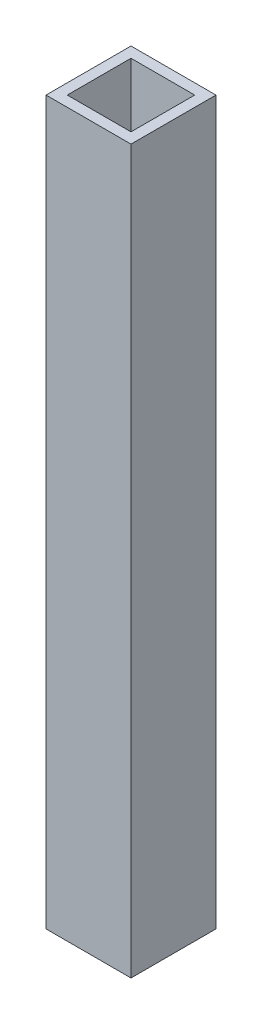
ISO-10303-21;
HEADER;
FILE_DESCRIPTION(('STEP AP214'),'2;1');
FILE_NAME('part.step','',(''),(''),'','','');
FILE_SCHEMA(('AUTOMOTIVE_DESIGN { 1 0 10303 214 1 1 1 1 }'));
ENDSEC;
DATA;
#1=APPLICATION_CONTEXT('core data for automotive mechanical design processes');
#2=APPLICATION_PROTOCOL_DEFINITION('international standard','automotive_design',2000,#1);
#3=PRODUCT_CONTEXT('',#1,'mechanical');
#4=PRODUCT('Part','Part','',(#3));
#5=PRODUCT_RELATED_PRODUCT_CATEGORY('part','',(#4));
#6=PRODUCT_DEFINITION_FORMATION('','',#4);
#7=PRODUCT_DEFINITION_CONTEXT('part definition',#1,'design');
#8=PRODUCT_DEFINITION('design','',#6,#7);
#9=PRODUCT_DEFINITION_SHAPE('','',#8);
#10=(LENGTH_UNIT() NAMED_UNIT(*) SI_UNIT(.MILLI.,.METRE.));
#11=(NAMED_UNIT(*) PLANE_ANGLE_UNIT() SI_UNIT($,.RADIAN.));
#12=(NAMED_UNIT(*) SI_UNIT($,.STERADIAN.) SOLID_ANGLE_UNIT());
#13=UNCERTAINTY_MEASURE_WITH_UNIT(LENGTH_MEASURE(1.E-05),#10,'distance_accuracy_value','');
#14=(GEOMETRIC_REPRESENTATION_CONTEXT(3) GLOBAL_UNCERTAINTY_ASSIGNED_CONTEXT((#13)) GLOBAL_UNIT_ASSIGNED_CONTEXT((#10,
#11,#12)) REPRESENTATION_CONTEXT('',''));
#15=CARTESIAN_POINT('',(0.,0.,0.));
#16=DIRECTION('',(0.,0.,1.));
#17=DIRECTION('',(1.,0.,0.));
#18=AXIS2_PLACEMENT_3D('',#15,#16,#17);
#19=CARTESIAN_POINT('',(-171.45,266.7,-3.84401965253075));
#20=DIRECTION('',(1.,0.,0.));
#21=DIRECTION('',(0.,0.,-1.));
#22=AXIS2_PLACEMENT_3D('',#19,#20,#21);
#23=PLANE('',#22);
#24=DIRECTION('',(0.,0.,1.));
#25=VECTOR('',#24,1.);
#26=CARTESIAN_POINT('',(-171.45,-165.1,-3.84401965253075));
#27=LINE('',#26,#25);
#28=CARTESIAN_POINT('',(-171.45,-165.1,6.35));
#29=VERTEX_POINT('',#28);
#30=CARTESIAN_POINT('',(-171.45,-165.1,44.45));
#31=VERTEX_POINT('',#30);
#32=EDGE_CURVE('E158',#29,#31,#27,.T.);
#33=ORIENTED_EDGE('',*,*,#32,.T.);
#34=DIRECTION('',(0.,-1.,0.));
#35=VECTOR('',#34,1.);
#36=CARTESIAN_POINT('',(-171.45,266.7,44.45));
#37=LINE('',#36,#35);
#38=CARTESIAN_POINT('',(-171.45,266.7,44.45));
#39=VERTEX_POINT('',#38);
#40=EDGE_CURVE('E11',#39,#31,#37,.T.);
#41=ORIENTED_EDGE('',*,*,#40,.F.);
#42=DIRECTION('',(0.,0.,1.));
#43=VECTOR('',#42,1.);
#44=CARTESIAN_POINT('',(-171.45,266.7,-3.84401965253075));
#45=LINE('',#44,#43);
#46=CARTESIAN_POINT('',(-171.45,266.7,6.35));
#47=VERTEX_POINT('',#46);
#48=EDGE_CURVE('E118',#47,#39,#45,.T.);
#49=ORIENTED_EDGE('',*,*,#48,.F.);
#50=DIRECTION('',(0.,-1.,0.));
#51=VECTOR('',#50,1.);
#52=CARTESIAN_POINT('',(-171.45,266.7,6.35));
#53=LINE('',#52,#51);
#54=EDGE_CURVE('E41',#47,#29,#53,.T.);
#55=ORIENTED_EDGE('',*,*,#54,.T.);
#56=EDGE_LOOP('',(#33,#41,#49,#55));
#57=FACE_BOUND('',#56,.T.);
#58=ADVANCED_FACE('F16',(#57),#23,.F.);
#59=CARTESIAN_POINT('',(-173.697840166092,266.7,44.45));
#60=DIRECTION('',(0.,0.,1.));
#61=DIRECTION('',(1.,0.,0.));
#62=AXIS2_PLACEMENT_3D('',#59,#60,#61);
#63=PLANE('',#62);
#64=DIRECTION('',(-1.,0.,0.));
#65=VECTOR('',#64,1.);
#66=CARTESIAN_POINT('',(-173.697840166092,-165.1,44.45));
#67=LINE('',#66,#65);
#68=CARTESIAN_POINT('',(-209.55,-165.1,44.45));
#69=VERTEX_POINT('',#68);
#70=EDGE_CURVE('E125',#31,#69,#67,.T.);
#71=ORIENTED_EDGE('',*,*,#70,.T.);
#72=DIRECTION('',(0.,-1.,0.));
#73=VECTOR('',#72,1.);
#74=CARTESIAN_POINT('',(-209.55,266.7,44.45));
#75=LINE('',#74,#73);
#76=CARTESIAN_POINT('',(-209.55,266.7,44.45));
#77=VERTEX_POINT('',#76);
#78=EDGE_CURVE('E27',#77,#69,#75,.T.);
#79=ORIENTED_EDGE('',*,*,#78,.F.);
#80=DIRECTION('',(-1.,0.,0.));
#81=VECTOR('',#80,1.);
#82=CARTESIAN_POINT('',(-173.697840166092,266.7,44.45));
#83=LINE('',#82,#81);
#84=EDGE_CURVE('E112',#39,#77,#83,.T.);
#85=ORIENTED_EDGE('',*,*,#84,.F.);
#86=ORIENTED_EDGE('',*,*,#40,.T.);
#87=EDGE_LOOP('',(#71,#79,#85,#86));
#88=FACE_BOUND('',#87,.T.);
#89=ADVANCED_FACE('F124',(#88),#63,.F.);
#90=CARTESIAN_POINT('',(-209.55,266.7,-3.84401965253073));
#91=DIRECTION('',(1.,0.,0.));
#92=DIRECTION('',(0.,0.,-1.));
#93=AXIS2_PLACEMENT_3D('',#90,#91,#92);
#94=PLANE('',#93);
#95=DIRECTION('',(0.,0.,1.));
#96=VECTOR('',#95,1.);
#97=CARTESIAN_POINT('',(-209.55,-165.1,-3.84401965253073));
#98=LINE('',#97,#96);
#99=CARTESIAN_POINT('',(-209.55,-165.1,6.35));
#100=VERTEX_POINT('',#99);
#101=EDGE_CURVE('E163',#100,#69,#98,.T.);
#102=ORIENTED_EDGE('',*,*,#101,.F.);
#103=DIRECTION('',(0.,-1.,0.));
#104=VECTOR('',#103,1.);
#105=CARTESIAN_POINT('',(-209.55,266.7,6.35));
#106=LINE('',#105,#104);
#107=CARTESIAN_POINT('',(-209.55,266.7,6.35));
#108=VERTEX_POINT('',#107);
#109=EDGE_CURVE('E75',#108,#100,#106,.T.);
#110=ORIENTED_EDGE('',*,*,#109,.F.);
#111=DIRECTION('',(0.,0.,1.));
#112=VECTOR('',#111,1.);
#113=CARTESIAN_POINT('',(-209.55,266.7,-3.84401965253073));
#114=LINE('',#113,#112);
#115=EDGE_CURVE('E117',#108,#77,#114,.T.);
#116=ORIENTED_EDGE('',*,*,#115,.T.);
#117=ORIENTED_EDGE('',*,*,#78,.T.);
#118=EDGE_LOOP('',(#102,#110,#116,#117));
#119=FACE_BOUND('',#118,.T.);
#120=ADVANCED_FACE('F130',(#119),#94,.T.);
#121=CARTESIAN_POINT('',(-190.5,266.7,50.8));
#122=DIRECTION('',(0.,0.,1.));
#123=DIRECTION('',(1.,0.,0.));
#124=AXIS2_PLACEMENT_3D('',#121,#122,#123);
#125=PLANE('',#124);
#126=DIRECTION('',(-1.,0.,0.));
#127=VECTOR('',#126,1.);
#128=CARTESIAN_POINT('',(-190.5,-165.1,50.8));
#129=LINE('',#128,#127);
#130=CARTESIAN_POINT('',(-165.1,-165.1,50.8));
#131=VERTEX_POINT('',#130);
#132=CARTESIAN_POINT('',(-215.9,-165.1,50.8));
#133=VERTEX_POINT('',#132);
#134=EDGE_CURVE('E142',#131,#133,#129,.T.);
#135=ORIENTED_EDGE('',*,*,#134,.F.);
#136=DIRECTION('',(0.,-1.,0.));
#137=VECTOR('',#136,1.);
#138=CARTESIAN_POINT('',(-165.1,266.7,50.8));
#139=LINE('',#138,#137);
#140=CARTESIAN_POINT('',(-165.1,266.7,50.8));
#141=VERTEX_POINT('',#140);
#142=EDGE_CURVE('E20',#141,#131,#139,.T.);
#143=ORIENTED_EDGE('',*,*,#142,.F.);
#144=DIRECTION('',(-1.,0.,0.));
#145=VECTOR('',#144,1.);
#146=CARTESIAN_POINT('',(-190.5,266.7,50.8));
#147=LINE('',#146,#145);
#148=CARTESIAN_POINT('',(-215.9,266.7,50.8));
#149=VERTEX_POINT('',#148);
#150=EDGE_CURVE('E170',#141,#149,#147,.T.);
#151=ORIENTED_EDGE('',*,*,#150,.T.);
#152=DIRECTION('',(0.,-1.,0.));
#153=VECTOR('',#152,1.);
#154=CARTESIAN_POINT('',(-215.9,266.7,50.8));
#155=LINE('',#154,#153);
#156=EDGE_CURVE('E138',#149,#133,#155,.T.);
#157=ORIENTED_EDGE('',*,*,#156,.T.);
#158=EDGE_LOOP('',(#135,#143,#151,#157));
#159=FACE_BOUND('',#158,.T.);
#160=ADVANCED_FACE('F18',(#159),#125,.T.);
#161=CARTESIAN_POINT('',(-165.1,266.7,2082.8));
#162=DIRECTION('',(-1.,0.,0.));
#163=DIRECTION('',(0.,0.,1.));
#164=AXIS2_PLACEMENT_3D('',#161,#162,#163);
#165=PLANE('',#164);
#166=DIRECTION('',(0.,0.,-1.));
#167=VECTOR('',#166,1.);
#168=CARTESIAN_POINT('',(-165.1,-165.1,2082.8));
#169=LINE('',#168,#167);
#170=CARTESIAN_POINT('',(-165.1,-165.1,0.));
#171=VERTEX_POINT('',#170);
#172=EDGE_CURVE('E146',#131,#171,#169,.T.);
#173=ORIENTED_EDGE('',*,*,#172,.T.);
#174=DIRECTION('',(0.,-1.,0.));
#175=VECTOR('',#174,1.);
#176=CARTESIAN_POINT('',(-165.1,266.7,0.));
#177=LINE('',#176,#175);
#178=CARTESIAN_POINT('',(-165.1,266.7,0.));
#179=VERTEX_POINT('',#178);
#180=EDGE_CURVE('E179',#179,#171,#177,.T.);
#181=ORIENTED_EDGE('',*,*,#180,.F.);
#182=DIRECTION('',(0.,0.,-1.));
#183=VECTOR('',#182,1.);
#184=CARTESIAN_POINT('',(-165.1,266.7,2082.8));
#185=LINE('',#184,#183);
#186=EDGE_CURVE('E192',#141,#179,#185,.T.);
#187=ORIENTED_EDGE('',*,*,#186,.F.);
#188=ORIENTED_EDGE('',*,*,#142,.T.);
#189=EDGE_LOOP('',(#173,#181,#187,#188));
#190=FACE_BOUND('',#189,.T.);
#191=ADVANCED_FACE('F191',(#190),#165,.F.);
#192=CARTESIAN_POINT('',(-190.5,266.7,0.));
#193=DIRECTION('',(0.,0.,-1.));
#194=DIRECTION('',(-1.,0.,0.));
#195=AXIS2_PLACEMENT_3D('',#192,#193,#194);
#196=PLANE('',#195);
#197=DIRECTION('',(1.,0.,0.));
#198=VECTOR('',#197,1.);
#199=CARTESIAN_POINT('',(-190.5,-165.1,0.));
#200=LINE('',#199,#198);
#201=CARTESIAN_POINT('',(-215.9,-165.1,0.));
#202=VERTEX_POINT('',#201);
#203=EDGE_CURVE('E150',#202,#171,#200,.T.);
#204=ORIENTED_EDGE('',*,*,#203,.F.);
#205=DIRECTION('',(0.,-1.,0.));
#206=VECTOR('',#205,1.);
#207=CARTESIAN_POINT('',(-215.9,266.7,0.));
#208=LINE('',#207,#206);
#209=CARTESIAN_POINT('',(-215.9,266.7,0.));
#210=VERTEX_POINT('',#209);
#211=EDGE_CURVE('E177',#210,#202,#208,.T.);
#212=ORIENTED_EDGE('',*,*,#211,.F.);
#213=DIRECTION('',(1.,0.,0.));
#214=VECTOR('',#213,1.);
#215=CARTESIAN_POINT('',(-190.5,266.7,0.));
#216=LINE('',#215,#214);
#217=EDGE_CURVE('E237',#210,#179,#216,.T.);
#218=ORIENTED_EDGE('',*,*,#217,.T.);
#219=ORIENTED_EDGE('',*,*,#180,.T.);
#220=EDGE_LOOP('',(#204,#212,#218,#219));
#221=FACE_BOUND('',#220,.T.);
#222=ADVANCED_FACE('F204',(#221),#196,.T.);
#223=CARTESIAN_POINT('',(-215.9,266.7,2082.8));
#224=DIRECTION('',(-1.,0.,0.));
#225=DIRECTION('',(0.,0.,1.));
#226=AXIS2_PLACEMENT_3D('',#223,#224,#225);
#227=PLANE('',#226);
#228=DIRECTION('',(0.,0.,-1.));
#229=VECTOR('',#228,1.);
#230=CARTESIAN_POINT('',(-215.9,-165.1,2082.8));
#231=LINE('',#230,#229);
#232=EDGE_CURVE('E154',#133,#202,#231,.T.);
#233=ORIENTED_EDGE('',*,*,#232,.F.);
#234=ORIENTED_EDGE('',*,*,#156,.F.);
#235=DIRECTION('',(0.,0.,-1.));
#236=VECTOR('',#235,1.);
#237=CARTESIAN_POINT('',(-215.9,266.7,2082.8));
#238=LINE('',#237,#236);
#239=EDGE_CURVE('E202',#149,#210,#238,.T.);
#240=ORIENTED_EDGE('',*,*,#239,.T.);
#241=ORIENTED_EDGE('',*,*,#211,.T.);
#242=EDGE_LOOP('',(#233,#234,#240,#241));
#243=FACE_BOUND('',#242,.T.);
#244=ADVANCED_FACE('F201',(#243),#227,.T.);
#245=CARTESIAN_POINT('',(-207.302159833908,266.7,6.35));
#246=DIRECTION('',(0.,0.,1.));
#247=DIRECTION('',(1.,0.,0.));
#248=AXIS2_PLACEMENT_3D('',#245,#246,#247);
#249=PLANE('',#248);
#250=DIRECTION('',(-1.,0.,0.));
#251=VECTOR('',#250,1.);
#252=CARTESIAN_POINT('',(-207.302159833908,-165.1,6.35));
#253=LINE('',#252,#251);
#254=EDGE_CURVE('E166',#29,#100,#253,.T.);
#255=ORIENTED_EDGE('',*,*,#254,.F.);
#256=ORIENTED_EDGE('',*,*,#54,.F.);
#257=DIRECTION('',(-1.,0.,0.));
#258=VECTOR('',#257,1.);
#259=CARTESIAN_POINT('',(-207.302159833908,266.7,6.35));
#260=LINE('',#259,#258);
#261=EDGE_CURVE('E132',#47,#108,#260,.T.);
#262=ORIENTED_EDGE('',*,*,#261,.T.);
#263=ORIENTED_EDGE('',*,*,#109,.T.);
#264=EDGE_LOOP('',(#255,#256,#262,#263));
#265=FACE_BOUND('',#264,.T.);
#266=ADVANCED_FACE('F213',(#265),#249,.T.);
#267=CARTESIAN_POINT('',(-190.5,266.7,1041.4));
#268=DIRECTION('',(0.,1.,0.));
#269=DIRECTION('',(-1.,0.,0.));
#270=AXIS2_PLACEMENT_3D('',#267,#268,#269);
#271=PLANE('',#270);
#272=ORIENTED_EDGE('',*,*,#150,.F.);
#273=ORIENTED_EDGE('',*,*,#186,.T.);
#274=ORIENTED_EDGE('',*,*,#217,.F.);
#275=ORIENTED_EDGE('',*,*,#239,.F.);
#276=EDGE_LOOP('',(#272,#273,#274,#275));
#277=FACE_BOUND('',#276,.T.);
#278=ORIENTED_EDGE('',*,*,#48,.T.);
#279=ORIENTED_EDGE('',*,*,#84,.T.);
#280=ORIENTED_EDGE('',*,*,#115,.F.);
#281=ORIENTED_EDGE('',*,*,#261,.F.);
#282=EDGE_LOOP('',(#278,#279,#280,#281));
#283=FACE_BOUND('',#282,.T.);
#284=ADVANCED_FACE('F114',(#277,#283),#271,.T.);
#285=CARTESIAN_POINT('',(-190.5,-165.1,1041.4));
#286=DIRECTION('',(0.,1.,0.));
#287=DIRECTION('',(-1.,0.,0.));
#288=AXIS2_PLACEMENT_3D('',#285,#286,#287);
#289=PLANE('',#288);
#290=ORIENTED_EDGE('',*,*,#134,.T.);
#291=ORIENTED_EDGE('',*,*,#232,.T.);
#292=ORIENTED_EDGE('',*,*,#203,.T.);
#293=ORIENTED_EDGE('',*,*,#172,.F.);
#294=EDGE_LOOP('',(#290,#291,#292,#293));
#295=FACE_BOUND('',#294,.T.);
#296=ORIENTED_EDGE('',*,*,#32,.F.);
#297=ORIENTED_EDGE('',*,*,#254,.T.);
#298=ORIENTED_EDGE('',*,*,#101,.T.);
#299=ORIENTED_EDGE('',*,*,#70,.F.);
#300=EDGE_LOOP('',(#296,#297,#298,#299));
#301=FACE_BOUND('',#300,.T.);
#302=ADVANCED_FACE('F195',(#295,#301),#289,.F.);
#303=CLOSED_SHELL('',(#58,#89,#120,#160,#191,#222,#244,#266,#284,#302));
#304=MANIFOLD_SOLID_BREP('B1',#303);
#305=ADVANCED_BREP_SHAPE_REPRESENTATION('',(#18,#304),#14);
#306=SHAPE_DEFINITION_REPRESENTATION(#9,#305);
ENDSEC;
END-ISO-10303-21;
